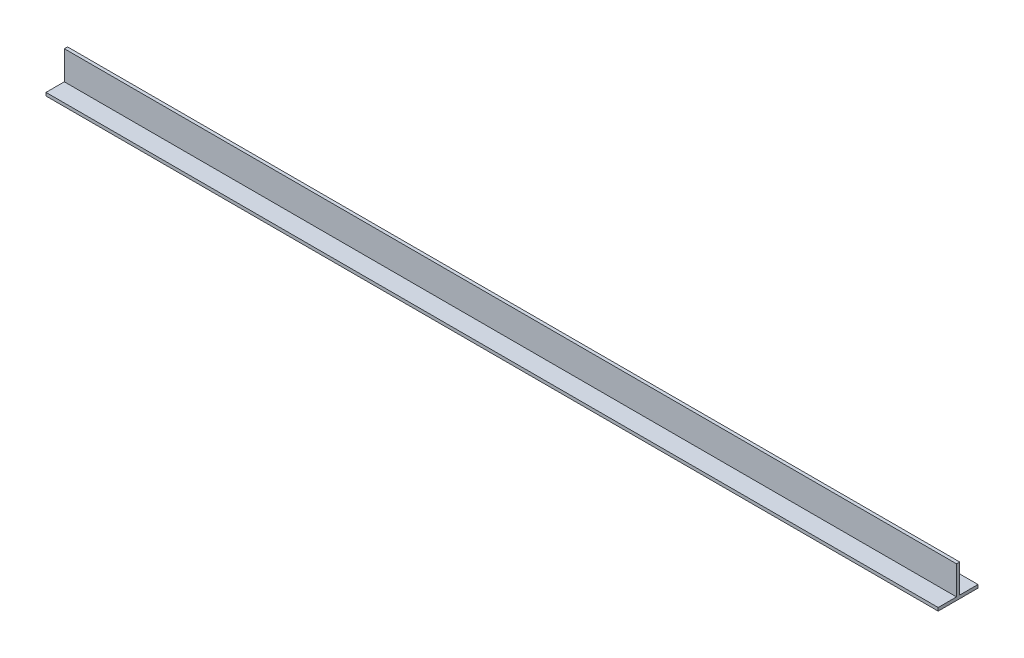
ISO-10303-21;
HEADER;
FILE_DESCRIPTION(('STEP AP214'),'2;1');
FILE_NAME('part.step','',(''),(''),'','','');
FILE_SCHEMA(('AUTOMOTIVE_DESIGN { 1 0 10303 214 1 1 1 1 }'));
ENDSEC;
DATA;
#1=APPLICATION_CONTEXT('core data for automotive mechanical design processes');
#2=APPLICATION_PROTOCOL_DEFINITION('international standard','automotive_design',2000,#1);
#3=PRODUCT_CONTEXT('',#1,'mechanical');
#4=PRODUCT('Part','Part','',(#3));
#5=PRODUCT_RELATED_PRODUCT_CATEGORY('part','',(#4));
#6=PRODUCT_DEFINITION_FORMATION('','',#4);
#7=PRODUCT_DEFINITION_CONTEXT('part definition',#1,'design');
#8=PRODUCT_DEFINITION('design','',#6,#7);
#9=PRODUCT_DEFINITION_SHAPE('','',#8);
#10=(LENGTH_UNIT() NAMED_UNIT(*) SI_UNIT(.MILLI.,.METRE.));
#11=(NAMED_UNIT(*) PLANE_ANGLE_UNIT() SI_UNIT($,.RADIAN.));
#12=(NAMED_UNIT(*) SI_UNIT($,.STERADIAN.) SOLID_ANGLE_UNIT());
#13=UNCERTAINTY_MEASURE_WITH_UNIT(LENGTH_MEASURE(1.E-05),#10,'distance_accuracy_value','');
#14=(GEOMETRIC_REPRESENTATION_CONTEXT(3) GLOBAL_UNCERTAINTY_ASSIGNED_CONTEXT((#13)) GLOBAL_UNIT_ASSIGNED_CONTEXT((#10,
#11,#12)) REPRESENTATION_CONTEXT('',''));
#15=CARTESIAN_POINT('',(0.,0.,0.));
#16=DIRECTION('',(0.,0.,1.));
#17=DIRECTION('',(1.,0.,0.));
#18=AXIS2_PLACEMENT_3D('',#15,#16,#17);
#19=CARTESIAN_POINT('',(355.6,0.,7.9375));
#20=DIRECTION('',(0.,0.,-1.));
#21=DIRECTION('',(-1.,0.,0.));
#22=AXIS2_PLACEMENT_3D('',#19,#20,#21);
#23=PLANE('',#22);
#24=DIRECTION('',(0.,-1.,0.));
#25=VECTOR('',#24,1.);
#26=CARTESIAN_POINT('',(0.,0.,7.9375));
#27=LINE('',#26,#25);
#28=CARTESIAN_POINT('',(0.,0.,7.9375));
#29=VERTEX_POINT('',#28);
#30=CARTESIAN_POINT('',(0.,-1.27,7.9375));
#31=VERTEX_POINT('',#30);
#32=EDGE_CURVE('E128',#29,#31,#27,.T.);
#33=ORIENTED_EDGE('',*,*,#32,.T.);
#34=DIRECTION('',(-1.,0.,0.));
#35=VECTOR('',#34,1.);
#36=CARTESIAN_POINT('',(355.6,-1.27,7.9375));
#37=LINE('',#36,#35);
#38=CARTESIAN_POINT('',(355.6,-1.27,7.9375));
#39=VERTEX_POINT('',#38);
#40=EDGE_CURVE('E11',#39,#31,#37,.T.);
#41=ORIENTED_EDGE('',*,*,#40,.F.);
#42=DIRECTION('',(0.,-1.,0.));
#43=VECTOR('',#42,1.);
#44=CARTESIAN_POINT('',(355.6,0.,7.9375));
#45=LINE('',#44,#43);
#46=CARTESIAN_POINT('',(355.6,0.,7.9375));
#47=VERTEX_POINT('',#46);
#48=EDGE_CURVE('E143',#47,#39,#45,.T.);
#49=ORIENTED_EDGE('',*,*,#48,.F.);
#50=DIRECTION('',(-1.,0.,0.));
#51=VECTOR('',#50,1.);
#52=CARTESIAN_POINT('',(355.6,0.,7.9375));
#53=LINE('',#52,#51);
#54=EDGE_CURVE('E124',#47,#29,#53,.T.);
#55=ORIENTED_EDGE('',*,*,#54,.T.);
#56=EDGE_LOOP('',(#33,#41,#49,#55));
#57=FACE_BOUND('',#56,.T.);
#58=ADVANCED_FACE('F32',(#57),#23,.F.);
#59=CARTESIAN_POINT('',(355.6,-1.27,7.9375));
#60=DIRECTION('',(0.,1.,0.));
#61=DIRECTION('',(0.,0.,1.));
#62=AXIS2_PLACEMENT_3D('',#59,#60,#61);
#63=PLANE('',#62);
#64=CARTESIAN_POINT('',(330.2,-1.27,-4.28625));
#65=DIRECTION('',(0.,1.,0.));
#66=DIRECTION('',(0.,0.,1.));
#67=AXIS2_PLACEMENT_3D('',#64,#65,#66);
#68=CIRCLE('',#67,2.15265000000003);
#69=CARTESIAN_POINT('',(330.2,-1.27,-2.13359999999997));
#70=VERTEX_POINT('',#69);
#71=EDGE_CURVE('E193',#70,#70,#68,.F.);
#72=ORIENTED_EDGE('',*,*,#71,.F.);
#73=EDGE_LOOP('',(#72));
#74=FACE_BOUND('',#73,.T.);
#75=CARTESIAN_POINT('',(228.6,-1.27,-4.28625));
#76=DIRECTION('',(0.,1.,0.));
#77=DIRECTION('',(0.,0.,1.));
#78=AXIS2_PLACEMENT_3D('',#75,#76,#77);
#79=CIRCLE('',#78,2.15265000000001);
#80=CARTESIAN_POINT('',(228.6,-1.27,-2.13359999999999));
#81=VERTEX_POINT('',#80);
#82=EDGE_CURVE('E187',#81,#81,#79,.F.);
#83=ORIENTED_EDGE('',*,*,#82,.F.);
#84=EDGE_LOOP('',(#83));
#85=FACE_BOUND('',#84,.T.);
#86=CARTESIAN_POINT('',(127.,-1.27,-4.28625));
#87=DIRECTION('',(0.,1.,0.));
#88=DIRECTION('',(0.,0.,1.));
#89=AXIS2_PLACEMENT_3D('',#86,#87,#88);
#90=CIRCLE('',#89,2.15264999999998);
#91=CARTESIAN_POINT('',(127.,-1.27,-2.13360000000002));
#92=VERTEX_POINT('',#91);
#93=EDGE_CURVE('E181',#92,#92,#90,.F.);
#94=ORIENTED_EDGE('',*,*,#93,.F.);
#95=EDGE_LOOP('',(#94));
#96=FACE_BOUND('',#95,.T.);
#97=CARTESIAN_POINT('',(25.4,-1.27,-4.28625));
#98=DIRECTION('',(0.,1.,0.));
#99=DIRECTION('',(0.,0.,1.));
#100=AXIS2_PLACEMENT_3D('',#97,#98,#99);
#101=CIRCLE('',#100,2.15265);
#102=CARTESIAN_POINT('',(25.4,-1.27,-2.1336));
#103=VERTEX_POINT('',#102);
#104=EDGE_CURVE('E132',#103,#103,#101,.F.);
#105=ORIENTED_EDGE('',*,*,#104,.F.);
#106=EDGE_LOOP('',(#105));
#107=FACE_BOUND('',#106,.T.);
#108=DIRECTION('',(0.,0.,-1.));
#109=VECTOR('',#108,1.);
#110=CARTESIAN_POINT('',(0.,-1.27,7.9375));
#111=LINE('',#110,#109);
#112=CARTESIAN_POINT('',(0.,-1.27,-7.9375));
#113=VERTEX_POINT('',#112);
#114=EDGE_CURVE('E131',#31,#113,#111,.T.);
#115=ORIENTED_EDGE('',*,*,#114,.T.);
#116=DIRECTION('',(-1.,0.,0.));
#117=VECTOR('',#116,1.);
#118=CARTESIAN_POINT('',(355.6,-1.27,-7.9375));
#119=LINE('',#118,#117);
#120=CARTESIAN_POINT('',(355.6,-1.27,-7.9375));
#121=VERTEX_POINT('',#120);
#122=EDGE_CURVE('E40',#121,#113,#119,.T.);
#123=ORIENTED_EDGE('',*,*,#122,.F.);
#124=DIRECTION('',(0.,0.,-1.));
#125=VECTOR('',#124,1.);
#126=CARTESIAN_POINT('',(355.6,-1.27,7.9375));
#127=LINE('',#126,#125);
#128=EDGE_CURVE('E91',#39,#121,#127,.T.);
#129=ORIENTED_EDGE('',*,*,#128,.F.);
#130=ORIENTED_EDGE('',*,*,#40,.T.);
#131=EDGE_LOOP('',(#115,#123,#129,#130));
#132=FACE_BOUND('',#131,.T.);
#133=ADVANCED_FACE('F219',(#74,#85,#96,#107,#132),#63,.F.);
#134=CARTESIAN_POINT('',(355.6,0.,-7.9375));
#135=DIRECTION('',(0.,0.,1.));
#136=DIRECTION('',(1.,0.,0.));
#137=AXIS2_PLACEMENT_3D('',#134,#135,#136);
#138=PLANE('',#137);
#139=DIRECTION('',(0.,1.,0.));
#140=VECTOR('',#139,1.);
#141=CARTESIAN_POINT('',(0.,0.,-7.9375));
#142=LINE('',#141,#140);
#143=CARTESIAN_POINT('',(0.,0.,-7.9375));
#144=VERTEX_POINT('',#143);
#145=EDGE_CURVE('E134',#113,#144,#142,.T.);
#146=ORIENTED_EDGE('',*,*,#145,.T.);
#147=DIRECTION('',(-1.,0.,0.));
#148=VECTOR('',#147,1.);
#149=CARTESIAN_POINT('',(355.6,0.,-7.9375));
#150=LINE('',#149,#148);
#151=CARTESIAN_POINT('',(355.6,0.,-7.9375));
#152=VERTEX_POINT('',#151);
#153=EDGE_CURVE('E150',#152,#144,#150,.T.);
#154=ORIENTED_EDGE('',*,*,#153,.F.);
#155=DIRECTION('',(0.,1.,0.));
#156=VECTOR('',#155,1.);
#157=CARTESIAN_POINT('',(355.6,0.,-7.9375));
#158=LINE('',#157,#156);
#159=EDGE_CURVE('E158',#121,#152,#158,.T.);
#160=ORIENTED_EDGE('',*,*,#159,.F.);
#161=ORIENTED_EDGE('',*,*,#122,.T.);
#162=EDGE_LOOP('',(#146,#154,#160,#161));
#163=FACE_BOUND('',#162,.T.);
#164=ADVANCED_FACE('F156',(#163),#138,.F.);
#165=CARTESIAN_POINT('',(355.6,0.,-0.635));
#166=DIRECTION('',(0.,-1.,0.));
#167=DIRECTION('',(0.,0.,-1.));
#168=AXIS2_PLACEMENT_3D('',#165,#166,#167);
#169=PLANE('',#168);
#170=CARTESIAN_POINT('',(330.2,0.,-4.28625));
#171=DIRECTION('',(0.,1.,0.));
#172=DIRECTION('',(0.,0.,1.));
#173=AXIS2_PLACEMENT_3D('',#170,#171,#172);
#174=CIRCLE('',#173,2.15265000000003);
#175=CARTESIAN_POINT('',(330.2,0.,-2.13359999999997));
#176=VERTEX_POINT('',#175);
#177=EDGE_CURVE('E196',#176,#176,#174,.T.);
#178=ORIENTED_EDGE('',*,*,#177,.F.);
#179=EDGE_LOOP('',(#178));
#180=FACE_BOUND('',#179,.T.);
#181=CARTESIAN_POINT('',(228.6,0.,-4.28625));
#182=DIRECTION('',(0.,1.,0.));
#183=DIRECTION('',(0.,0.,1.));
#184=AXIS2_PLACEMENT_3D('',#181,#182,#183);
#185=CIRCLE('',#184,2.15265000000001);
#186=CARTESIAN_POINT('',(228.6,0.,-2.13359999999999));
#187=VERTEX_POINT('',#186);
#188=EDGE_CURVE('E190',#187,#187,#185,.T.);
#189=ORIENTED_EDGE('',*,*,#188,.F.);
#190=EDGE_LOOP('',(#189));
#191=FACE_BOUND('',#190,.T.);
#192=CARTESIAN_POINT('',(127.,0.,-4.28625));
#193=DIRECTION('',(0.,1.,0.));
#194=DIRECTION('',(0.,0.,1.));
#195=AXIS2_PLACEMENT_3D('',#192,#193,#194);
#196=CIRCLE('',#195,2.15264999999998);
#197=CARTESIAN_POINT('',(127.,0.,-2.13360000000002));
#198=VERTEX_POINT('',#197);
#199=EDGE_CURVE('E184',#198,#198,#196,.T.);
#200=ORIENTED_EDGE('',*,*,#199,.F.);
#201=EDGE_LOOP('',(#200));
#202=FACE_BOUND('',#201,.T.);
#203=CARTESIAN_POINT('',(25.4,0.,-4.28625));
#204=DIRECTION('',(0.,1.,0.));
#205=DIRECTION('',(0.,0.,1.));
#206=AXIS2_PLACEMENT_3D('',#203,#204,#205);
#207=CIRCLE('',#206,2.15265);
#208=CARTESIAN_POINT('',(25.4,0.,-2.1336));
#209=VERTEX_POINT('',#208);
#210=EDGE_CURVE('E178',#209,#209,#207,.T.);
#211=ORIENTED_EDGE('',*,*,#210,.F.);
#212=EDGE_LOOP('',(#211));
#213=FACE_BOUND('',#212,.T.);
#214=DIRECTION('',(0.,0.,1.));
#215=VECTOR('',#214,1.);
#216=CARTESIAN_POINT('',(0.,0.,-0.635));
#217=LINE('',#216,#215);
#218=CARTESIAN_POINT('',(0.,0.,-0.635));
#219=VERTEX_POINT('',#218);
#220=EDGE_CURVE('E136',#144,#219,#217,.T.);
#221=ORIENTED_EDGE('',*,*,#220,.T.);
#222=DIRECTION('',(-1.,0.,0.));
#223=VECTOR('',#222,1.);
#224=CARTESIAN_POINT('',(355.6,0.,-0.635));
#225=LINE('',#224,#223);
#226=CARTESIAN_POINT('',(355.6,0.,-0.635));
#227=VERTEX_POINT('',#226);
#228=EDGE_CURVE('E147',#227,#219,#225,.T.);
#229=ORIENTED_EDGE('',*,*,#228,.F.);
#230=DIRECTION('',(0.,0.,1.));
#231=VECTOR('',#230,1.);
#232=CARTESIAN_POINT('',(355.6,0.,-0.635));
#233=LINE('',#232,#231);
#234=EDGE_CURVE('E170',#152,#227,#233,.T.);
#235=ORIENTED_EDGE('',*,*,#234,.F.);
#236=ORIENTED_EDGE('',*,*,#153,.T.);
#237=EDGE_LOOP('',(#221,#229,#235,#236));
#238=FACE_BOUND('',#237,.T.);
#239=ADVANCED_FACE('F166',(#180,#191,#202,#213,#238),#169,.F.);
#240=CARTESIAN_POINT('',(355.6,11.43,-0.635));
#241=DIRECTION('',(0.,0.,1.));
#242=DIRECTION('',(1.,0.,0.));
#243=AXIS2_PLACEMENT_3D('',#240,#241,#242);
#244=PLANE('',#243);
#245=DIRECTION('',(0.,1.,0.));
#246=VECTOR('',#245,1.);
#247=CARTESIAN_POINT('',(0.,11.43,-0.635));
#248=LINE('',#247,#246);
#249=CARTESIAN_POINT('',(0.,11.43,-0.635));
#250=VERTEX_POINT('',#249);
#251=EDGE_CURVE('E138',#219,#250,#248,.T.);
#252=ORIENTED_EDGE('',*,*,#251,.T.);
#253=DIRECTION('',(-1.,0.,0.));
#254=VECTOR('',#253,1.);
#255=CARTESIAN_POINT('',(355.6,11.43,-0.635));
#256=LINE('',#255,#254);
#257=CARTESIAN_POINT('',(355.6,11.43,-0.635));
#258=VERTEX_POINT('',#257);
#259=EDGE_CURVE('E119',#258,#250,#256,.T.);
#260=ORIENTED_EDGE('',*,*,#259,.F.);
#261=DIRECTION('',(0.,1.,0.));
#262=VECTOR('',#261,1.);
#263=CARTESIAN_POINT('',(355.6,11.43,-0.635));
#264=LINE('',#263,#262);
#265=EDGE_CURVE('E110',#227,#258,#264,.T.);
#266=ORIENTED_EDGE('',*,*,#265,.F.);
#267=ORIENTED_EDGE('',*,*,#228,.T.);
#268=EDGE_LOOP('',(#252,#260,#266,#267));
#269=FACE_BOUND('',#268,.T.);
#270=ADVANCED_FACE('F169',(#269),#244,.F.);
#271=CARTESIAN_POINT('',(355.6,11.43,0.635));
#272=DIRECTION('',(0.,-1.,0.));
#273=DIRECTION('',(0.,0.,-1.));
#274=AXIS2_PLACEMENT_3D('',#271,#272,#273);
#275=PLANE('',#274);
#276=DIRECTION('',(0.,0.,1.));
#277=VECTOR('',#276,1.);
#278=CARTESIAN_POINT('',(0.,11.43,0.635));
#279=LINE('',#278,#277);
#280=CARTESIAN_POINT('',(0.,11.43,0.635));
#281=VERTEX_POINT('',#280);
#282=EDGE_CURVE('E118',#250,#281,#279,.T.);
#283=ORIENTED_EDGE('',*,*,#282,.T.);
#284=DIRECTION('',(-1.,0.,0.));
#285=VECTOR('',#284,1.);
#286=CARTESIAN_POINT('',(355.6,11.43,0.635));
#287=LINE('',#286,#285);
#288=CARTESIAN_POINT('',(355.6,11.43,0.635));
#289=VERTEX_POINT('',#288);
#290=EDGE_CURVE('E115',#289,#281,#287,.T.);
#291=ORIENTED_EDGE('',*,*,#290,.F.);
#292=DIRECTION('',(0.,0.,1.));
#293=VECTOR('',#292,1.);
#294=CARTESIAN_POINT('',(355.6,11.43,0.635));
#295=LINE('',#294,#293);
#296=EDGE_CURVE('E104',#258,#289,#295,.T.);
#297=ORIENTED_EDGE('',*,*,#296,.F.);
#298=ORIENTED_EDGE('',*,*,#259,.T.);
#299=EDGE_LOOP('',(#283,#291,#297,#298));
#300=FACE_BOUND('',#299,.T.);
#301=ADVANCED_FACE('F116',(#300),#275,.F.);
#302=CARTESIAN_POINT('',(355.6,11.43,0.635));
#303=DIRECTION('',(0.,0.,-1.));
#304=DIRECTION('',(-1.,0.,0.));
#305=AXIS2_PLACEMENT_3D('',#302,#303,#304);
#306=PLANE('',#305);
#307=DIRECTION('',(0.,-1.,0.));
#308=VECTOR('',#307,1.);
#309=CARTESIAN_POINT('',(0.,11.43,0.635));
#310=LINE('',#309,#308);
#311=CARTESIAN_POINT('',(0.,0.,0.635));
#312=VERTEX_POINT('',#311);
#313=EDGE_CURVE('E77',#281,#312,#310,.T.);
#314=ORIENTED_EDGE('',*,*,#313,.T.);
#315=DIRECTION('',(-1.,0.,0.));
#316=VECTOR('',#315,1.);
#317=CARTESIAN_POINT('',(355.6,0.,0.635));
#318=LINE('',#317,#316);
#319=CARTESIAN_POINT('',(355.6,0.,0.635));
#320=VERTEX_POINT('',#319);
#321=EDGE_CURVE('E120',#320,#312,#318,.T.);
#322=ORIENTED_EDGE('',*,*,#321,.F.);
#323=DIRECTION('',(0.,-1.,0.));
#324=VECTOR('',#323,1.);
#325=CARTESIAN_POINT('',(355.6,11.43,0.635));
#326=LINE('',#325,#324);
#327=EDGE_CURVE('E108',#289,#320,#326,.T.);
#328=ORIENTED_EDGE('',*,*,#327,.F.);
#329=ORIENTED_EDGE('',*,*,#290,.T.);
#330=EDGE_LOOP('',(#314,#322,#328,#329));
#331=FACE_BOUND('',#330,.T.);
#332=ADVANCED_FACE('F122',(#331),#306,.F.);
#333=CARTESIAN_POINT('',(355.6,0.,7.9375));
#334=DIRECTION('',(0.,-1.,0.));
#335=DIRECTION('',(0.,0.,-1.));
#336=AXIS2_PLACEMENT_3D('',#333,#334,#335);
#337=PLANE('',#336);
#338=DIRECTION('',(0.,0.,1.));
#339=VECTOR('',#338,1.);
#340=CARTESIAN_POINT('',(0.,0.,7.9375));
#341=LINE('',#340,#339);
#342=EDGE_CURVE('E83',#312,#29,#341,.T.);
#343=ORIENTED_EDGE('',*,*,#342,.T.);
#344=ORIENTED_EDGE('',*,*,#54,.F.);
#345=DIRECTION('',(0.,0.,1.));
#346=VECTOR('',#345,1.);
#347=CARTESIAN_POINT('',(355.6,0.,7.9375));
#348=LINE('',#347,#346);
#349=EDGE_CURVE('E48',#320,#47,#348,.T.);
#350=ORIENTED_EDGE('',*,*,#349,.F.);
#351=ORIENTED_EDGE('',*,*,#321,.T.);
#352=EDGE_LOOP('',(#343,#344,#350,#351));
#353=FACE_BOUND('',#352,.T.);
#354=ADVANCED_FACE('F225',(#353),#337,.F.);
#355=CARTESIAN_POINT('',(355.6,0.,0.));
#356=DIRECTION('',(1.,0.,0.));
#357=DIRECTION('',(0.,0.,-1.));
#358=AXIS2_PLACEMENT_3D('',#355,#356,#357);
#359=PLANE('',#358);
#360=ORIENTED_EDGE('',*,*,#48,.T.);
#361=ORIENTED_EDGE('',*,*,#128,.T.);
#362=ORIENTED_EDGE('',*,*,#159,.T.);
#363=ORIENTED_EDGE('',*,*,#234,.T.);
#364=ORIENTED_EDGE('',*,*,#265,.T.);
#365=ORIENTED_EDGE('',*,*,#296,.T.);
#366=ORIENTED_EDGE('',*,*,#327,.T.);
#367=ORIENTED_EDGE('',*,*,#349,.T.);
#368=EDGE_LOOP('',(#360,#361,#362,#363,#364,#365,#366,#367));
#369=FACE_BOUND('',#368,.T.);
#370=ADVANCED_FACE('F106',(#369),#359,.T.);
#371=CARTESIAN_POINT('',(0.,0.,0.));
#372=DIRECTION('',(1.,0.,0.));
#373=DIRECTION('',(0.,0.,-1.));
#374=AXIS2_PLACEMENT_3D('',#371,#372,#373);
#375=PLANE('',#374);
#376=ORIENTED_EDGE('',*,*,#32,.F.);
#377=ORIENTED_EDGE('',*,*,#342,.F.);
#378=ORIENTED_EDGE('',*,*,#313,.F.);
#379=ORIENTED_EDGE('',*,*,#282,.F.);
#380=ORIENTED_EDGE('',*,*,#251,.F.);
#381=ORIENTED_EDGE('',*,*,#220,.F.);
#382=ORIENTED_EDGE('',*,*,#145,.F.);
#383=ORIENTED_EDGE('',*,*,#114,.F.);
#384=EDGE_LOOP('',(#376,#377,#378,#379,#380,#381,#382,#383));
#385=FACE_BOUND('',#384,.T.);
#386=ADVANCED_FACE('F162',(#385),#375,.F.);
#387=CARTESIAN_POINT('',(25.4,-1.271,-4.28625));
#388=DIRECTION('',(0.,1.,0.));
#389=DIRECTION('',(0.,0.,1.));
#390=AXIS2_PLACEMENT_3D('',#387,#388,#389);
#391=CYLINDRICAL_SURFACE('',#390,2.15265);
#392=ORIENTED_EDGE('',*,*,#210,.T.);
#393=EDGE_LOOP('',(#392));
#394=FACE_BOUND('',#393,.T.);
#395=ORIENTED_EDGE('',*,*,#104,.T.);
#396=EDGE_LOOP('',(#395));
#397=FACE_BOUND('',#396,.T.);
#398=ADVANCED_FACE('F212',(#394,#397),#391,.F.);
#399=CARTESIAN_POINT('',(127.,-1.271,-4.28625));
#400=DIRECTION('',(0.,1.,0.));
#401=DIRECTION('',(0.,0.,1.));
#402=AXIS2_PLACEMENT_3D('',#399,#400,#401);
#403=CYLINDRICAL_SURFACE('',#402,2.15264999999998);
#404=ORIENTED_EDGE('',*,*,#199,.T.);
#405=EDGE_LOOP('',(#404));
#406=FACE_BOUND('',#405,.T.);
#407=ORIENTED_EDGE('',*,*,#93,.T.);
#408=EDGE_LOOP('',(#407));
#409=FACE_BOUND('',#408,.T.);
#410=ADVANCED_FACE('F215',(#406,#409),#403,.F.);
#411=CARTESIAN_POINT('',(228.6,-1.271,-4.28625));
#412=DIRECTION('',(0.,1.,0.));
#413=DIRECTION('',(0.,0.,1.));
#414=AXIS2_PLACEMENT_3D('',#411,#412,#413);
#415=CYLINDRICAL_SURFACE('',#414,2.15265000000001);
#416=ORIENTED_EDGE('',*,*,#188,.T.);
#417=EDGE_LOOP('',(#416));
#418=FACE_BOUND('',#417,.T.);
#419=ORIENTED_EDGE('',*,*,#82,.T.);
#420=EDGE_LOOP('',(#419));
#421=FACE_BOUND('',#420,.T.);
#422=ADVANCED_FACE('F301',(#418,#421),#415,.F.);
#423=CARTESIAN_POINT('',(330.2,-1.271,-4.28625));
#424=DIRECTION('',(0.,1.,0.));
#425=DIRECTION('',(0.,0.,1.));
#426=AXIS2_PLACEMENT_3D('',#423,#424,#425);
#427=CYLINDRICAL_SURFACE('',#426,2.15265000000003);
#428=ORIENTED_EDGE('',*,*,#177,.T.);
#429=EDGE_LOOP('',(#428));
#430=FACE_BOUND('',#429,.T.);
#431=ORIENTED_EDGE('',*,*,#71,.T.);
#432=EDGE_LOOP('',(#431));
#433=FACE_BOUND('',#432,.T.);
#434=ADVANCED_FACE('F200',(#430,#433),#427,.F.);
#435=CLOSED_SHELL('',(#58,#133,#164,#239,#270,#301,#332,#354,#370,#386,#398,#410,#422,#434));
#436=MANIFOLD_SOLID_BREP('B2',#435);
#437=ADVANCED_BREP_SHAPE_REPRESENTATION('',(#18,#436),#14);
#438=SHAPE_DEFINITION_REPRESENTATION(#9,#437);
ENDSEC;
END-ISO-10303-21;
